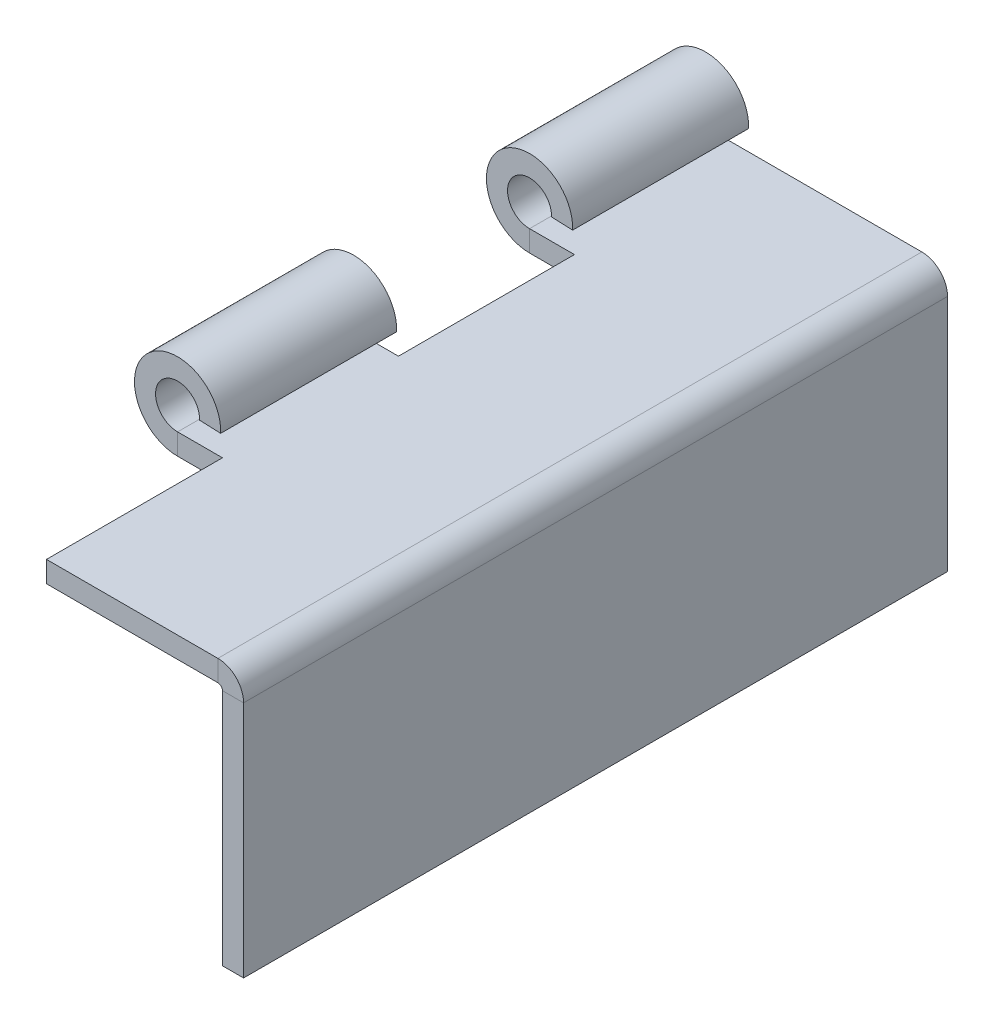
ISO-10303-21;
HEADER;
FILE_DESCRIPTION(('STEP AP214'),'2;1');
FILE_NAME('part.step','',(''),(''),'','','');
FILE_SCHEMA(('AUTOMOTIVE_DESIGN { 1 0 10303 214 1 1 1 1 }'));
ENDSEC;
DATA;
#1=APPLICATION_CONTEXT('core data for automotive mechanical design processes');
#2=APPLICATION_PROTOCOL_DEFINITION('international standard','automotive_design',2000,#1);
#3=PRODUCT_CONTEXT('',#1,'mechanical');
#4=PRODUCT('Part','Part','',(#3));
#5=PRODUCT_RELATED_PRODUCT_CATEGORY('part','',(#4));
#6=PRODUCT_DEFINITION_FORMATION('','',#4);
#7=PRODUCT_DEFINITION_CONTEXT('part definition',#1,'design');
#8=PRODUCT_DEFINITION('design','',#6,#7);
#9=PRODUCT_DEFINITION_SHAPE('','',#8);
#10=(LENGTH_UNIT() NAMED_UNIT(*) SI_UNIT(.MILLI.,.METRE.));
#11=(NAMED_UNIT(*) PLANE_ANGLE_UNIT() SI_UNIT($,.RADIAN.));
#12=(NAMED_UNIT(*) SI_UNIT($,.STERADIAN.) SOLID_ANGLE_UNIT());
#13=UNCERTAINTY_MEASURE_WITH_UNIT(LENGTH_MEASURE(1.E-05),#10,'distance_accuracy_value','');
#14=(GEOMETRIC_REPRESENTATION_CONTEXT(3) GLOBAL_UNCERTAINTY_ASSIGNED_CONTEXT((#13)) GLOBAL_UNIT_ASSIGNED_CONTEXT((#10,
#11,#12)) REPRESENTATION_CONTEXT('',''));
#15=CARTESIAN_POINT('',(0.,0.,0.));
#16=DIRECTION('',(0.,0.,1.));
#17=DIRECTION('',(1.,0.,0.));
#18=AXIS2_PLACEMENT_3D('',#15,#16,#17);
#19=CARTESIAN_POINT('',(0.,-1.524,50.8));
#20=DIRECTION('',(0.,-1.,0.));
#21=DIRECTION('',(1.,0.,0.));
#22=AXIS2_PLACEMENT_3D('',#19,#20,#21);
#23=PLANE('',#22);
#24=DIRECTION('',(-1.,0.,0.));
#25=VECTOR('',#24,1.);
#26=CARTESIAN_POINT('',(0.,-1.524,0.));
#27=LINE('',#26,#25);
#28=CARTESIAN_POINT('',(-1.8542,-1.524,0.));
#29=VERTEX_POINT('',#28);
#30=CARTESIAN_POINT('',(-17.4625,-1.524,0.));
#31=VERTEX_POINT('',#30);
#32=EDGE_CURVE('E310',#29,#31,#27,.T.);
#33=ORIENTED_EDGE('',*,*,#32,.F.);
#34=DIRECTION('',(0.,0.,1.));
#35=VECTOR('',#34,1.);
#36=CARTESIAN_POINT('',(-1.8542,-1.524,50.8));
#37=LINE('',#36,#35);
#38=CARTESIAN_POINT('',(-1.8542,-1.524,50.8));
#39=VERTEX_POINT('',#38);
#40=EDGE_CURVE('E77',#39,#29,#37,.F.);
#41=ORIENTED_EDGE('',*,*,#40,.F.);
#42=DIRECTION('',(-1.,0.,0.));
#43=VECTOR('',#42,1.);
#44=CARTESIAN_POINT('',(0.,-1.524,50.8));
#45=LINE('',#44,#43);
#46=CARTESIAN_POINT('',(-14.224,-1.524,50.8));
#47=VERTEX_POINT('',#46);
#48=EDGE_CURVE('E296',#39,#47,#45,.T.);
#49=ORIENTED_EDGE('',*,*,#48,.T.);
#50=DIRECTION('',(0.,0.,1.));
#51=VECTOR('',#50,1.);
#52=CARTESIAN_POINT('',(-14.224,-1.524,50.8));
#53=LINE('',#52,#51);
#54=CARTESIAN_POINT('',(-14.224,-1.524,38.1));
#55=VERTEX_POINT('',#54);
#56=EDGE_CURVE('E276',#55,#47,#53,.T.);
#57=ORIENTED_EDGE('',*,*,#56,.F.);
#58=DIRECTION('',(1.,0.,0.));
#59=VECTOR('',#58,1.);
#60=CARTESIAN_POINT('',(-14.224,-1.524,38.1));
#61=LINE('',#60,#59);
#62=CARTESIAN_POINT('',(-17.4625,-1.524,38.1));
#63=VERTEX_POINT('',#62);
#64=EDGE_CURVE('E279',#63,#55,#61,.T.);
#65=ORIENTED_EDGE('',*,*,#64,.F.);
#66=DIRECTION('',(0.,0.,-1.));
#67=VECTOR('',#66,1.);
#68=CARTESIAN_POINT('',(-17.4625,-1.524,50.8));
#69=LINE('',#68,#67);
#70=CARTESIAN_POINT('',(-17.4625,-1.524,25.4));
#71=VERTEX_POINT('',#70);
#72=EDGE_CURVE('E317',#63,#71,#69,.T.);
#73=ORIENTED_EDGE('',*,*,#72,.T.);
#74=DIRECTION('',(-1.,0.,0.));
#75=VECTOR('',#74,1.);
#76=CARTESIAN_POINT('',(-14.224,-1.524,25.4));
#77=LINE('',#76,#75);
#78=CARTESIAN_POINT('',(-14.224,-1.524,25.4));
#79=VERTEX_POINT('',#78);
#80=EDGE_CURVE('E251',#79,#71,#77,.T.);
#81=ORIENTED_EDGE('',*,*,#80,.F.);
#82=DIRECTION('',(0.,0.,1.));
#83=VECTOR('',#82,1.);
#84=CARTESIAN_POINT('',(-14.224,-1.524,25.4));
#85=LINE('',#84,#83);
#86=CARTESIAN_POINT('',(-14.224,-1.524,12.7));
#87=VERTEX_POINT('',#86);
#88=EDGE_CURVE('E246',#87,#79,#85,.T.);
#89=ORIENTED_EDGE('',*,*,#88,.F.);
#90=DIRECTION('',(1.,0.,0.));
#91=VECTOR('',#90,1.);
#92=CARTESIAN_POINT('',(-14.224,-1.524,12.7));
#93=LINE('',#92,#91);
#94=CARTESIAN_POINT('',(-17.4625,-1.524,12.7));
#95=VERTEX_POINT('',#94);
#96=EDGE_CURVE('E254',#95,#87,#93,.T.);
#97=ORIENTED_EDGE('',*,*,#96,.F.);
#98=EDGE_CURVE('E316',#95,#31,#69,.T.);
#99=ORIENTED_EDGE('',*,*,#98,.T.);
#100=EDGE_LOOP('',(#33,#41,#49,#57,#65,#73,#81,#89,#97,#99));
#101=FACE_BOUND('',#100,.T.);
#102=ADVANCED_FACE('F62',(#101),#23,.T.);
#103=CARTESIAN_POINT('',(0.,0.,50.8));
#104=DIRECTION('',(0.,-1.,0.));
#105=DIRECTION('',(1.,0.,0.));
#106=AXIS2_PLACEMENT_3D('',#103,#104,#105);
#107=PLANE('',#106);
#108=DIRECTION('',(0.,0.,1.));
#109=VECTOR('',#108,1.);
#110=CARTESIAN_POINT('',(-1.8542,0.,50.8));
#111=LINE('',#110,#109);
#112=CARTESIAN_POINT('',(-1.8542,0.,50.8));
#113=VERTEX_POINT('',#112);
#114=CARTESIAN_POINT('',(-1.8542,0.,0.));
#115=VERTEX_POINT('',#114);
#116=EDGE_CURVE('E228',#113,#115,#111,.F.);
#117=ORIENTED_EDGE('',*,*,#116,.T.);
#118=DIRECTION('',(-1.,0.,0.));
#119=VECTOR('',#118,1.);
#120=CARTESIAN_POINT('',(0.,0.,0.));
#121=LINE('',#120,#119);
#122=CARTESIAN_POINT('',(-17.4625,0.,0.));
#123=VERTEX_POINT('',#122);
#124=EDGE_CURVE('E299',#115,#123,#121,.T.);
#125=ORIENTED_EDGE('',*,*,#124,.T.);
#126=DIRECTION('',(0.,0.,-1.));
#127=VECTOR('',#126,1.);
#128=CARTESIAN_POINT('',(-17.4625,0.,50.8));
#129=LINE('',#128,#127);
#130=CARTESIAN_POINT('',(-17.4625,0.,12.7));
#131=VERTEX_POINT('',#130);
#132=EDGE_CURVE('E301',#131,#123,#129,.T.);
#133=ORIENTED_EDGE('',*,*,#132,.F.);
#134=DIRECTION('',(1.,0.,0.));
#135=VECTOR('',#134,1.);
#136=CARTESIAN_POINT('',(0.,0.,12.7));
#137=LINE('',#136,#135);
#138=CARTESIAN_POINT('',(-14.224,0.,12.7));
#139=VERTEX_POINT('',#138);
#140=EDGE_CURVE('E345',#131,#139,#137,.T.);
#141=ORIENTED_EDGE('',*,*,#140,.T.);
#142=DIRECTION('',(0.,0.,1.));
#143=VECTOR('',#142,1.);
#144=CARTESIAN_POINT('',(-14.224,0.,50.8));
#145=LINE('',#144,#143);
#146=CARTESIAN_POINT('',(-14.224,0.,25.4));
#147=VERTEX_POINT('',#146);
#148=EDGE_CURVE('E342',#139,#147,#145,.T.);
#149=ORIENTED_EDGE('',*,*,#148,.T.);
#150=DIRECTION('',(-1.,0.,0.));
#151=VECTOR('',#150,1.);
#152=CARTESIAN_POINT('',(0.,0.,25.4));
#153=LINE('',#152,#151);
#154=CARTESIAN_POINT('',(-17.4625,0.,25.4));
#155=VERTEX_POINT('',#154);
#156=EDGE_CURVE('E339',#147,#155,#153,.T.);
#157=ORIENTED_EDGE('',*,*,#156,.T.);
#158=CARTESIAN_POINT('',(-17.4625,0.,38.1));
#159=VERTEX_POINT('',#158);
#160=EDGE_CURVE('E313',#159,#155,#129,.T.);
#161=ORIENTED_EDGE('',*,*,#160,.F.);
#162=DIRECTION('',(1.,0.,0.));
#163=VECTOR('',#162,1.);
#164=CARTESIAN_POINT('',(0.,0.,38.1));
#165=LINE('',#164,#163);
#166=CARTESIAN_POINT('',(-14.224,0.,38.1));
#167=VERTEX_POINT('',#166);
#168=EDGE_CURVE('E334',#159,#167,#165,.T.);
#169=ORIENTED_EDGE('',*,*,#168,.T.);
#170=DIRECTION('',(0.,0.,1.));
#171=VECTOR('',#170,1.);
#172=CARTESIAN_POINT('',(-14.224,0.,50.8));
#173=LINE('',#172,#171);
#174=CARTESIAN_POINT('',(-14.224,0.,50.8));
#175=VERTEX_POINT('',#174);
#176=EDGE_CURVE('E284',#167,#175,#173,.T.);
#177=ORIENTED_EDGE('',*,*,#176,.T.);
#178=DIRECTION('',(-1.,0.,0.));
#179=VECTOR('',#178,1.);
#180=CARTESIAN_POINT('',(0.,0.,50.8));
#181=LINE('',#180,#179);
#182=EDGE_CURVE('E298',#113,#175,#181,.T.);
#183=ORIENTED_EDGE('',*,*,#182,.F.);
#184=EDGE_LOOP('',(#117,#125,#133,#141,#149,#157,#161,#169,#177,#183));
#185=FACE_BOUND('',#184,.T.);
#186=ADVANCED_FACE('F418',(#185),#107,.F.);
#187=CARTESIAN_POINT('',(-17.4625,1.5875,50.8));
#188=DIRECTION('',(0.,0.,-1.));
#189=DIRECTION('',(-1.,0.,0.));
#190=AXIS2_PLACEMENT_3D('',#187,#188,#189);
#191=PLANE('',#190);
#192=DIRECTION('',(0.,1.,0.));
#193=VECTOR('',#192,1.);
#194=CARTESIAN_POINT('',(-1.8542,-1.524,50.8));
#195=LINE('',#194,#193);
#196=EDGE_CURVE('E235',#39,#113,#195,.T.);
#197=ORIENTED_EDGE('',*,*,#196,.T.);
#198=ORIENTED_EDGE('',*,*,#182,.T.);
#199=DIRECTION('',(0.,-1.,0.));
#200=VECTOR('',#199,1.);
#201=CARTESIAN_POINT('',(-14.224,1.5875,50.8));
#202=LINE('',#201,#200);
#203=EDGE_CURVE('E331',#175,#47,#202,.T.);
#204=ORIENTED_EDGE('',*,*,#203,.T.);
#205=ORIENTED_EDGE('',*,*,#48,.F.);
#206=EDGE_LOOP('',(#197,#198,#204,#205));
#207=FACE_BOUND('',#206,.T.);
#208=ADVANCED_FACE('F390',(#207),#191,.F.);
#209=CARTESIAN_POINT('',(-14.224,4.69899999999999,25.4));
#210=DIRECTION('',(0.,0.,1.));
#211=DIRECTION('',(1.,0.,0.));
#212=AXIS2_PLACEMENT_3D('',#209,#210,#211);
#213=PLANE('',#212);
#214=ORIENTED_EDGE('',*,*,#80,.T.);
#215=DIRECTION('',(0.,1.,0.));
#216=VECTOR('',#215,1.);
#217=CARTESIAN_POINT('',(-17.4625,-1.524,25.4));
#218=LINE('',#217,#216);
#219=EDGE_CURVE('E13',#71,#155,#218,.T.);
#220=ORIENTED_EDGE('',*,*,#219,.T.);
#221=ORIENTED_EDGE('',*,*,#156,.F.);
#222=DIRECTION('',(0.,-1.,0.));
#223=VECTOR('',#222,1.);
#224=CARTESIAN_POINT('',(-14.224,4.69899999999999,25.4));
#225=LINE('',#224,#223);
#226=EDGE_CURVE('E257',#147,#79,#225,.T.);
#227=ORIENTED_EDGE('',*,*,#226,.T.);
#228=EDGE_LOOP('',(#214,#220,#221,#227));
#229=FACE_BOUND('',#228,.T.);
#230=ADVANCED_FACE('F421',(#229),#213,.F.);
#231=CARTESIAN_POINT('',(-14.224,4.69899999999999,12.7));
#232=DIRECTION('',(0.,0.,-1.));
#233=DIRECTION('',(-1.,0.,0.));
#234=AXIS2_PLACEMENT_3D('',#231,#232,#233);
#235=PLANE('',#234);
#236=ORIENTED_EDGE('',*,*,#140,.F.);
#237=DIRECTION('',(0.,-1.,0.));
#238=VECTOR('',#237,1.);
#239=CARTESIAN_POINT('',(-17.4625,0.,12.7));
#240=LINE('',#239,#238);
#241=EDGE_CURVE('E70',#131,#95,#240,.T.);
#242=ORIENTED_EDGE('',*,*,#241,.T.);
#243=ORIENTED_EDGE('',*,*,#96,.T.);
#244=DIRECTION('',(0.,-1.,0.));
#245=VECTOR('',#244,1.);
#246=CARTESIAN_POINT('',(-14.224,4.69899999999999,12.7));
#247=LINE('',#246,#245);
#248=EDGE_CURVE('E258',#139,#87,#247,.T.);
#249=ORIENTED_EDGE('',*,*,#248,.F.);
#250=EDGE_LOOP('',(#236,#242,#243,#249));
#251=FACE_BOUND('',#250,.T.);
#252=ADVANCED_FACE('F349',(#251),#235,.F.);
#253=CARTESIAN_POINT('',(-17.4625,1.5875,50.8));
#254=DIRECTION('',(0.,0.,-1.));
#255=DIRECTION('',(-1.,0.,0.));
#256=AXIS2_PLACEMENT_3D('',#253,#254,#255);
#257=CYLINDRICAL_SURFACE('',#256,1.5875);
#258=DIRECTION('',(0.,0.,-1.));
#259=VECTOR('',#258,1.);
#260=CARTESIAN_POINT('',(-15.8762705084068,1.524,50.8));
#261=LINE('',#260,#259);
#262=CARTESIAN_POINT('',(-15.8762705084068,1.524,12.7));
#263=VERTEX_POINT('',#262);
#264=CARTESIAN_POINT('',(-15.8762705084068,1.524,0.));
#265=VERTEX_POINT('',#264);
#266=EDGE_CURVE('E324',#263,#265,#261,.T.);
#267=ORIENTED_EDGE('',*,*,#266,.F.);
#268=CARTESIAN_POINT('',(-17.4625,1.5875,12.7));
#269=DIRECTION('',(0.,0.,-1.));
#270=DIRECTION('',(-1.,0.,0.));
#271=AXIS2_PLACEMENT_3D('',#268,#269,#270);
#272=CIRCLE('',#271,1.5875);
#273=EDGE_CURVE('E268',#263,#131,#272,.F.);
#274=ORIENTED_EDGE('',*,*,#273,.T.);
#275=ORIENTED_EDGE('',*,*,#132,.T.);
#276=CARTESIAN_POINT('',(-17.4625,1.5875,0.));
#277=DIRECTION('',(0.,0.,-1.));
#278=DIRECTION('',(-1.,0.,0.));
#279=AXIS2_PLACEMENT_3D('',#276,#277,#278);
#280=CIRCLE('',#279,1.5875);
#281=EDGE_CURVE('E295',#123,#265,#280,.T.);
#282=ORIENTED_EDGE('',*,*,#281,.T.);
#283=EDGE_LOOP('',(#267,#274,#275,#282));
#284=FACE_BOUND('',#283,.T.);
#285=ADVANCED_FACE('F428',(#284),#257,.F.);
#286=CARTESIAN_POINT('',(-14.3534901964773,1.46304,50.8));
#287=DIRECTION('',(-0.0399999999999982,-0.999199679743744,0.));
#288=DIRECTION('',(0.999199679743744,-0.0399999999999982,0.));
#289=AXIS2_PLACEMENT_3D('',#286,#287,#288);
#290=PLANE('',#289);
#291=DIRECTION('',(0.999199679743744,-0.0399999999999982,0.));
#292=VECTOR('',#291,1.);
#293=CARTESIAN_POINT('',(-14.3534901964773,1.46304,12.7));
#294=LINE('',#293,#292);
#295=CARTESIAN_POINT('',(-14.3534901964773,1.46304,12.7));
#296=VERTEX_POINT('',#295);
#297=EDGE_CURVE('E271',#263,#296,#294,.T.);
#298=ORIENTED_EDGE('',*,*,#297,.F.);
#299=ORIENTED_EDGE('',*,*,#266,.T.);
#300=DIRECTION('',(-0.999199679743744,0.0399999999999982,0.));
#301=VECTOR('',#300,1.);
#302=CARTESIAN_POINT('',(-14.3534901964773,1.46304,0.));
#303=LINE('',#302,#301);
#304=CARTESIAN_POINT('',(-14.3534901964773,1.46304,0.));
#305=VERTEX_POINT('',#304);
#306=EDGE_CURVE('E304',#305,#265,#303,.T.);
#307=ORIENTED_EDGE('',*,*,#306,.F.);
#308=DIRECTION('',(0.,0.,-1.));
#309=VECTOR('',#308,1.);
#310=CARTESIAN_POINT('',(-14.3534901964773,1.46304,50.8));
#311=LINE('',#310,#309);
#312=EDGE_CURVE('E320',#296,#305,#311,.T.);
#313=ORIENTED_EDGE('',*,*,#312,.F.);
#314=EDGE_LOOP('',(#298,#299,#307,#313));
#315=FACE_BOUND('',#314,.T.);
#316=ADVANCED_FACE('F430',(#315),#290,.T.);
#317=CARTESIAN_POINT('',(-17.4625,1.5875,50.8));
#318=DIRECTION('',(0.,0.,-1.));
#319=DIRECTION('',(-1.,0.,0.));
#320=AXIS2_PLACEMENT_3D('',#317,#318,#319);
#321=CYLINDRICAL_SURFACE('',#320,3.1115);
#322=CARTESIAN_POINT('',(-17.4625,1.5875,25.4));
#323=DIRECTION('',(0.,0.,1.));
#324=DIRECTION('',(1.,0.,0.));
#325=AXIS2_PLACEMENT_3D('',#322,#323,#324);
#326=CIRCLE('',#325,3.1115);
#327=CARTESIAN_POINT('',(-14.3534901964773,1.46304,25.4));
#328=VERTEX_POINT('',#327);
#329=EDGE_CURVE('E266',#71,#328,#326,.F.);
#330=ORIENTED_EDGE('',*,*,#329,.F.);
#331=ORIENTED_EDGE('',*,*,#72,.F.);
#332=CARTESIAN_POINT('',(-17.4625,1.5875,38.1));
#333=DIRECTION('',(0.,0.,-1.));
#334=DIRECTION('',(-1.,0.,0.));
#335=AXIS2_PLACEMENT_3D('',#332,#333,#334);
#336=CIRCLE('',#335,3.1115);
#337=CARTESIAN_POINT('',(-14.3534901964773,1.46304,38.1));
#338=VERTEX_POINT('',#337);
#339=EDGE_CURVE('E292',#338,#63,#336,.F.);
#340=ORIENTED_EDGE('',*,*,#339,.F.);
#341=EDGE_CURVE('E321',#338,#328,#311,.T.);
#342=ORIENTED_EDGE('',*,*,#341,.T.);
#343=EDGE_LOOP('',(#330,#331,#340,#342));
#344=FACE_BOUND('',#343,.T.);
#345=ADVANCED_FACE('F404',(#344),#321,.T.);
#346=CARTESIAN_POINT('',(-14.224,4.69899999999999,38.1));
#347=DIRECTION('',(0.,0.,-1.));
#348=DIRECTION('',(-1.,0.,0.));
#349=AXIS2_PLACEMENT_3D('',#346,#347,#348);
#350=PLANE('',#349);
#351=ORIENTED_EDGE('',*,*,#168,.F.);
#352=DIRECTION('',(0.,-1.,0.));
#353=VECTOR('',#352,1.);
#354=CARTESIAN_POINT('',(-17.4625,0.,38.1));
#355=LINE('',#354,#353);
#356=EDGE_CURVE('E337',#159,#63,#355,.T.);
#357=ORIENTED_EDGE('',*,*,#356,.T.);
#358=ORIENTED_EDGE('',*,*,#64,.T.);
#359=DIRECTION('',(0.,-1.,0.));
#360=VECTOR('',#359,1.);
#361=CARTESIAN_POINT('',(-14.224,4.69899999999999,38.1));
#362=LINE('',#361,#360);
#363=EDGE_CURVE('E282',#167,#55,#362,.T.);
#364=ORIENTED_EDGE('',*,*,#363,.F.);
#365=EDGE_LOOP('',(#351,#357,#358,#364));
#366=FACE_BOUND('',#365,.T.);
#367=ADVANCED_FACE('F399',(#366),#350,.F.);
#368=CARTESIAN_POINT('',(-17.4625,-1.524,0.));
#369=DIRECTION('',(0.,0.,-1.));
#370=DIRECTION('',(-1.,0.,0.));
#371=AXIS2_PLACEMENT_3D('',#368,#369,#370);
#372=PLANE('',#371);
#373=DIRECTION('',(0.,1.,0.));
#374=VECTOR('',#373,1.);
#375=CARTESIAN_POINT('',(-17.4625,-1.524,0.));
#376=LINE('',#375,#374);
#377=EDGE_CURVE('E328',#31,#123,#376,.T.);
#378=ORIENTED_EDGE('',*,*,#377,.F.);
#379=CARTESIAN_POINT('',(-17.4625,1.5875,0.));
#380=DIRECTION('',(0.,0.,1.));
#381=DIRECTION('',(1.,0.,0.));
#382=AXIS2_PLACEMENT_3D('',#379,#380,#381);
#383=CIRCLE('',#382,3.1115);
#384=EDGE_CURVE('E307',#31,#305,#383,.F.);
#385=ORIENTED_EDGE('',*,*,#384,.T.);
#386=ORIENTED_EDGE('',*,*,#306,.T.);
#387=ORIENTED_EDGE('',*,*,#281,.F.);
#388=EDGE_LOOP('',(#378,#385,#386,#387));
#389=FACE_BOUND('',#388,.T.);
#390=ADVANCED_FACE('F64',(#389),#372,.T.);
#391=ORIENTED_EDGE('',*,*,#160,.T.);
#392=CARTESIAN_POINT('',(-17.4625,1.5875,25.4));
#393=DIRECTION('',(0.,0.,1.));
#394=DIRECTION('',(1.,0.,0.));
#395=AXIS2_PLACEMENT_3D('',#392,#393,#394);
#396=CIRCLE('',#395,1.5875);
#397=CARTESIAN_POINT('',(-15.8762705084068,1.524,25.4));
#398=VERTEX_POINT('',#397);
#399=EDGE_CURVE('E260',#155,#398,#396,.F.);
#400=ORIENTED_EDGE('',*,*,#399,.T.);
#401=CARTESIAN_POINT('',(-15.8762705084068,1.524,38.1));
#402=VERTEX_POINT('',#401);
#403=EDGE_CURVE('E325',#402,#398,#261,.T.);
#404=ORIENTED_EDGE('',*,*,#403,.F.);
#405=CARTESIAN_POINT('',(-17.4625,1.5875,38.1));
#406=DIRECTION('',(0.,0.,-1.));
#407=DIRECTION('',(-1.,0.,0.));
#408=AXIS2_PLACEMENT_3D('',#405,#406,#407);
#409=CIRCLE('',#408,1.5875);
#410=EDGE_CURVE('E287',#402,#159,#409,.F.);
#411=ORIENTED_EDGE('',*,*,#410,.T.);
#412=EDGE_LOOP('',(#391,#400,#404,#411));
#413=FACE_BOUND('',#412,.T.);
#414=ADVANCED_FACE('F415',(#413),#257,.F.);
#415=DIRECTION('',(-0.999199679743744,0.0399999999999982,0.));
#416=VECTOR('',#415,1.);
#417=CARTESIAN_POINT('',(-14.3534901964773,1.46304,25.4));
#418=LINE('',#417,#416);
#419=EDGE_CURVE('E264',#328,#398,#418,.T.);
#420=ORIENTED_EDGE('',*,*,#419,.F.);
#421=ORIENTED_EDGE('',*,*,#341,.F.);
#422=DIRECTION('',(0.999199679743744,-0.0399999999999982,0.));
#423=VECTOR('',#422,1.);
#424=CARTESIAN_POINT('',(-14.3534901964773,1.46304,38.1));
#425=LINE('',#424,#423);
#426=EDGE_CURVE('E290',#402,#338,#425,.T.);
#427=ORIENTED_EDGE('',*,*,#426,.F.);
#428=ORIENTED_EDGE('',*,*,#403,.T.);
#429=EDGE_LOOP('',(#420,#421,#427,#428));
#430=FACE_BOUND('',#429,.T.);
#431=ADVANCED_FACE('F411',(#430),#290,.T.);
#432=CARTESIAN_POINT('',(-17.4625,1.5875,12.7));
#433=DIRECTION('',(0.,0.,-1.));
#434=DIRECTION('',(-1.,0.,0.));
#435=AXIS2_PLACEMENT_3D('',#432,#433,#434);
#436=CIRCLE('',#435,3.1115);
#437=EDGE_CURVE('E273',#296,#95,#436,.F.);
#438=ORIENTED_EDGE('',*,*,#437,.F.);
#439=ORIENTED_EDGE('',*,*,#312,.T.);
#440=ORIENTED_EDGE('',*,*,#384,.F.);
#441=ORIENTED_EDGE('',*,*,#98,.F.);
#442=EDGE_LOOP('',(#438,#439,#440,#441));
#443=FACE_BOUND('',#442,.T.);
#444=ADVANCED_FACE('F364',(#443),#321,.T.);
#445=CARTESIAN_POINT('',(-17.4625,1.5875,0.));
#446=DIRECTION('',(0.,0.,-1.));
#447=DIRECTION('',(-1.,0.,0.));
#448=AXIS2_PLACEMENT_3D('',#445,#446,#447);
#449=PLANE('',#448);
#450=DIRECTION('',(0.,1.,0.));
#451=VECTOR('',#450,1.);
#452=CARTESIAN_POINT('',(-1.8542,-1.524,0.));
#453=LINE('',#452,#451);
#454=EDGE_CURVE('E85',#29,#115,#453,.T.);
#455=ORIENTED_EDGE('',*,*,#454,.F.);
#456=ORIENTED_EDGE('',*,*,#32,.T.);
#457=ORIENTED_EDGE('',*,*,#377,.T.);
#458=ORIENTED_EDGE('',*,*,#124,.F.);
#459=EDGE_LOOP('',(#455,#456,#457,#458));
#460=FACE_BOUND('',#459,.T.);
#461=ADVANCED_FACE('F368',(#460),#449,.T.);
#462=CARTESIAN_POINT('',(-14.224,4.69899999999999,50.8));
#463=DIRECTION('',(1.,0.,0.));
#464=DIRECTION('',(0.,0.,-1.));
#465=AXIS2_PLACEMENT_3D('',#462,#463,#464);
#466=PLANE('',#465);
#467=ORIENTED_EDGE('',*,*,#363,.T.);
#468=ORIENTED_EDGE('',*,*,#56,.T.);
#469=ORIENTED_EDGE('',*,*,#203,.F.);
#470=ORIENTED_EDGE('',*,*,#176,.F.);
#471=EDGE_LOOP('',(#467,#468,#469,#470));
#472=FACE_BOUND('',#471,.T.);
#473=ADVANCED_FACE('F395',(#472),#466,.F.);
#474=ORIENTED_EDGE('',*,*,#356,.F.);
#475=ORIENTED_EDGE('',*,*,#410,.F.);
#476=ORIENTED_EDGE('',*,*,#426,.T.);
#477=ORIENTED_EDGE('',*,*,#339,.T.);
#478=EDGE_LOOP('',(#474,#475,#476,#477));
#479=FACE_BOUND('',#478,.T.);
#480=ADVANCED_FACE('F453',(#479),#350,.F.);
#481=CARTESIAN_POINT('',(-14.224,4.69899999999999,25.4));
#482=DIRECTION('',(1.,0.,0.));
#483=DIRECTION('',(0.,0.,-1.));
#484=AXIS2_PLACEMENT_3D('',#481,#482,#483);
#485=PLANE('',#484);
#486=ORIENTED_EDGE('',*,*,#248,.T.);
#487=ORIENTED_EDGE('',*,*,#88,.T.);
#488=ORIENTED_EDGE('',*,*,#226,.F.);
#489=ORIENTED_EDGE('',*,*,#148,.F.);
#490=EDGE_LOOP('',(#486,#487,#488,#489));
#491=FACE_BOUND('',#490,.T.);
#492=ADVANCED_FACE('F423',(#491),#485,.F.);
#493=ORIENTED_EDGE('',*,*,#241,.F.);
#494=ORIENTED_EDGE('',*,*,#273,.F.);
#495=ORIENTED_EDGE('',*,*,#297,.T.);
#496=ORIENTED_EDGE('',*,*,#437,.T.);
#497=EDGE_LOOP('',(#493,#494,#495,#496));
#498=FACE_BOUND('',#497,.T.);
#499=ADVANCED_FACE('F355',(#498),#235,.F.);
#500=ORIENTED_EDGE('',*,*,#219,.F.);
#501=ORIENTED_EDGE('',*,*,#329,.T.);
#502=ORIENTED_EDGE('',*,*,#419,.T.);
#503=ORIENTED_EDGE('',*,*,#399,.F.);
#504=EDGE_LOOP('',(#500,#501,#502,#503));
#505=FACE_BOUND('',#504,.T.);
#506=ADVANCED_FACE('F408',(#505),#213,.F.);
#507=CARTESIAN_POINT('',(-1.8542,-1.8542,0.));
#508=DIRECTION('',(0.,0.,-1.));
#509=DIRECTION('',(-1.,0.,0.));
#510=AXIS2_PLACEMENT_3D('',#507,#508,#509);
#511=PLANE('',#510);
#512=DIRECTION('',(-1.,0.,0.));
#513=VECTOR('',#512,1.);
#514=CARTESIAN_POINT('',(0.,-1.85419999999999,0.));
#515=LINE('',#514,#513);
#516=CARTESIAN_POINT('',(-1.524,-1.8542,0.));
#517=VERTEX_POINT('',#516);
#518=CARTESIAN_POINT('',(0.,-1.85419999999999,0.));
#519=VERTEX_POINT('',#518);
#520=EDGE_CURVE('E210',#517,#519,#515,.F.);
#521=ORIENTED_EDGE('',*,*,#520,.F.);
#522=CARTESIAN_POINT('',(-1.8542,-1.8542,0.));
#523=DIRECTION('',(0.,0.,1.));
#524=DIRECTION('',(1.,0.,0.));
#525=AXIS2_PLACEMENT_3D('',#522,#523,#524);
#526=CIRCLE('',#525,0.3302);
#527=EDGE_CURVE('E238',#29,#517,#526,.F.);
#528=ORIENTED_EDGE('',*,*,#527,.F.);
#529=ORIENTED_EDGE('',*,*,#454,.T.);
#530=CARTESIAN_POINT('',(-1.8542,-1.8542,0.));
#531=DIRECTION('',(0.,0.,1.));
#532=DIRECTION('',(1.,0.,0.));
#533=AXIS2_PLACEMENT_3D('',#530,#531,#532);
#534=CIRCLE('',#533,1.8542);
#535=EDGE_CURVE('E231',#115,#519,#534,.F.);
#536=ORIENTED_EDGE('',*,*,#535,.T.);
#537=EDGE_LOOP('',(#521,#528,#529,#536));
#538=FACE_BOUND('',#537,.T.);
#539=ADVANCED_FACE('F375',(#538),#511,.T.);
#540=CARTESIAN_POINT('',(-1.8542,-1.8542,50.8));
#541=DIRECTION('',(0.,0.,-1.));
#542=DIRECTION('',(-1.,0.,0.));
#543=AXIS2_PLACEMENT_3D('',#540,#541,#542);
#544=PLANE('',#543);
#545=CARTESIAN_POINT('',(-1.8542,-1.8542,50.8));
#546=DIRECTION('',(0.,0.,1.));
#547=DIRECTION('',(1.,0.,0.));
#548=AXIS2_PLACEMENT_3D('',#545,#546,#547);
#549=CIRCLE('',#548,0.3302);
#550=CARTESIAN_POINT('',(-1.524,-1.8542,50.8));
#551=VERTEX_POINT('',#550);
#552=EDGE_CURVE('E242',#551,#39,#549,.T.);
#553=ORIENTED_EDGE('',*,*,#552,.F.);
#554=DIRECTION('',(-1.,0.,0.));
#555=VECTOR('',#554,1.);
#556=CARTESIAN_POINT('',(-1.524,-1.8542,50.8));
#557=LINE('',#556,#555);
#558=CARTESIAN_POINT('',(0.,-1.85419999999999,50.8));
#559=VERTEX_POINT('',#558);
#560=EDGE_CURVE('E222',#551,#559,#557,.F.);
#561=ORIENTED_EDGE('',*,*,#560,.T.);
#562=CARTESIAN_POINT('',(-1.8542,-1.8542,50.8));
#563=DIRECTION('',(0.,0.,1.));
#564=DIRECTION('',(1.,0.,0.));
#565=AXIS2_PLACEMENT_3D('',#562,#563,#564);
#566=CIRCLE('',#565,1.8542);
#567=EDGE_CURVE('E232',#559,#113,#566,.T.);
#568=ORIENTED_EDGE('',*,*,#567,.T.);
#569=ORIENTED_EDGE('',*,*,#196,.F.);
#570=EDGE_LOOP('',(#553,#561,#568,#569));
#571=FACE_BOUND('',#570,.T.);
#572=ADVANCED_FACE('F388',(#571),#544,.F.);
#573=CARTESIAN_POINT('',(-1.8542,-1.8542,50.8));
#574=DIRECTION('',(0.,0.,1.));
#575=DIRECTION('',(1.,0.,0.));
#576=AXIS2_PLACEMENT_3D('',#573,#574,#575);
#577=CYLINDRICAL_SURFACE('',#576,1.8542);
#578=ORIENTED_EDGE('',*,*,#116,.F.);
#579=ORIENTED_EDGE('',*,*,#567,.F.);
#580=DIRECTION('',(0.,0.,1.));
#581=VECTOR('',#580,1.);
#582=CARTESIAN_POINT('',(0.,-1.85419999999999,0.));
#583=LINE('',#582,#581);
#584=EDGE_CURVE('E220',#559,#519,#583,.F.);
#585=ORIENTED_EDGE('',*,*,#584,.T.);
#586=ORIENTED_EDGE('',*,*,#535,.F.);
#587=EDGE_LOOP('',(#578,#579,#585,#586));
#588=FACE_BOUND('',#587,.T.);
#589=ADVANCED_FACE('F379',(#588),#577,.T.);
#590=CARTESIAN_POINT('',(-1.8542,-1.8542,50.8));
#591=DIRECTION('',(0.,0.,1.));
#592=DIRECTION('',(1.,0.,0.));
#593=AXIS2_PLACEMENT_3D('',#590,#591,#592);
#594=CYLINDRICAL_SURFACE('',#593,0.3302);
#595=ORIENTED_EDGE('',*,*,#40,.T.);
#596=ORIENTED_EDGE('',*,*,#527,.T.);
#597=DIRECTION('',(0.,0.,1.));
#598=VECTOR('',#597,1.);
#599=CARTESIAN_POINT('',(-1.524,-1.8542,0.));
#600=LINE('',#599,#598);
#601=EDGE_CURVE('E225',#517,#551,#600,.T.);
#602=ORIENTED_EDGE('',*,*,#601,.T.);
#603=ORIENTED_EDGE('',*,*,#552,.T.);
#604=EDGE_LOOP('',(#595,#596,#602,#603));
#605=FACE_BOUND('',#604,.T.);
#606=ADVANCED_FACE('F371',(#605),#594,.F.);
#607=CARTESIAN_POINT('',(0.,-19.05,50.8));
#608=DIRECTION('',(0.,0.,-1.));
#609=DIRECTION('',(-1.,0.,0.));
#610=AXIS2_PLACEMENT_3D('',#607,#608,#609);
#611=PLANE('',#610);
#612=ORIENTED_EDGE('',*,*,#560,.F.);
#613=DIRECTION('',(0.,1.,0.));
#614=VECTOR('',#613,1.);
#615=CARTESIAN_POINT('',(-1.52399999999994,-19.05,50.8));
#616=LINE('',#615,#614);
#617=CARTESIAN_POINT('',(-1.52399999999994,-19.05,50.8));
#618=VERTEX_POINT('',#617);
#619=EDGE_CURVE('E218',#551,#618,#616,.F.);
#620=ORIENTED_EDGE('',*,*,#619,.T.);
#621=DIRECTION('',(-1.,0.,0.));
#622=VECTOR('',#621,1.);
#623=CARTESIAN_POINT('',(0.,-19.05,50.8));
#624=LINE('',#623,#622);
#625=CARTESIAN_POINT('',(0.,-19.05,50.8));
#626=VERTEX_POINT('',#625);
#627=EDGE_CURVE('E206',#626,#618,#624,.T.);
#628=ORIENTED_EDGE('',*,*,#627,.F.);
#629=DIRECTION('',(0.,-1.,0.));
#630=VECTOR('',#629,1.);
#631=CARTESIAN_POINT('',(0.,0.,50.8));
#632=LINE('',#631,#630);
#633=EDGE_CURVE('E193',#559,#626,#632,.T.);
#634=ORIENTED_EDGE('',*,*,#633,.F.);
#635=EDGE_LOOP('',(#612,#620,#628,#634));
#636=FACE_BOUND('',#635,.T.);
#637=ADVANCED_FACE('F382',(#636),#611,.F.);
#638=CARTESIAN_POINT('',(0.,-1.52399999999999,0.));
#639=DIRECTION('',(0.,0.,1.));
#640=DIRECTION('',(1.,0.,0.));
#641=AXIS2_PLACEMENT_3D('',#638,#639,#640);
#642=PLANE('',#641);
#643=ORIENTED_EDGE('',*,*,#520,.T.);
#644=DIRECTION('',(0.,1.,0.));
#645=VECTOR('',#644,1.);
#646=CARTESIAN_POINT('',(0.,0.,0.));
#647=LINE('',#646,#645);
#648=CARTESIAN_POINT('',(0.,-19.05,0.));
#649=VERTEX_POINT('',#648);
#650=EDGE_CURVE('E191',#649,#519,#647,.T.);
#651=ORIENTED_EDGE('',*,*,#650,.F.);
#652=DIRECTION('',(-1.,0.,0.));
#653=VECTOR('',#652,1.);
#654=CARTESIAN_POINT('',(0.,-19.05,0.));
#655=LINE('',#654,#653);
#656=CARTESIAN_POINT('',(-1.52399999999994,-19.05,0.));
#657=VERTEX_POINT('',#656);
#658=EDGE_CURVE('E199',#649,#657,#655,.T.);
#659=ORIENTED_EDGE('',*,*,#658,.T.);
#660=DIRECTION('',(0.,-1.,0.));
#661=VECTOR('',#660,1.);
#662=CARTESIAN_POINT('',(-1.524,-1.524,0.));
#663=LINE('',#662,#661);
#664=EDGE_CURVE('E215',#657,#517,#663,.F.);
#665=ORIENTED_EDGE('',*,*,#664,.T.);
#666=EDGE_LOOP('',(#643,#651,#659,#665));
#667=FACE_BOUND('',#666,.T.);
#668=ADVANCED_FACE('F209',(#667),#642,.F.);
#669=CARTESIAN_POINT('',(0.,0.,0.));
#670=DIRECTION('',(-1.,0.,0.));
#671=DIRECTION('',(0.,-1.,0.));
#672=AXIS2_PLACEMENT_3D('',#669,#670,#671);
#673=PLANE('',#672);
#674=ORIENTED_EDGE('',*,*,#584,.F.);
#675=ORIENTED_EDGE('',*,*,#633,.T.);
#676=DIRECTION('',(0.,0.,-1.));
#677=VECTOR('',#676,1.);
#678=CARTESIAN_POINT('',(0.,-19.05,0.));
#679=LINE('',#678,#677);
#680=EDGE_CURVE('E186',#626,#649,#679,.T.);
#681=ORIENTED_EDGE('',*,*,#680,.T.);
#682=ORIENTED_EDGE('',*,*,#650,.T.);
#683=EDGE_LOOP('',(#674,#675,#681,#682));
#684=FACE_BOUND('',#683,.T.);
#685=ADVANCED_FACE('F189',(#684),#673,.F.);
#686=CARTESIAN_POINT('',(-1.52400000000001,0.,0.));
#687=DIRECTION('',(-1.,0.,0.));
#688=DIRECTION('',(0.,-1.,0.));
#689=AXIS2_PLACEMENT_3D('',#686,#687,#688);
#690=PLANE('',#689);
#691=ORIENTED_EDGE('',*,*,#619,.F.);
#692=ORIENTED_EDGE('',*,*,#601,.F.);
#693=ORIENTED_EDGE('',*,*,#664,.F.);
#694=DIRECTION('',(0.,0.,1.));
#695=VECTOR('',#694,1.);
#696=CARTESIAN_POINT('',(-1.52399999999994,-19.05,0.));
#697=LINE('',#696,#695);
#698=EDGE_CURVE('E202',#618,#657,#697,.F.);
#699=ORIENTED_EDGE('',*,*,#698,.F.);
#700=EDGE_LOOP('',(#691,#692,#693,#699));
#701=FACE_BOUND('',#700,.T.);
#702=ADVANCED_FACE('F385',(#701),#690,.T.);
#703=CARTESIAN_POINT('',(0.,-19.05,0.));
#704=DIRECTION('',(0.,1.,0.));
#705=DIRECTION('',(-1.,0.,0.));
#706=AXIS2_PLACEMENT_3D('',#703,#704,#705);
#707=PLANE('',#706);
#708=ORIENTED_EDGE('',*,*,#698,.T.);
#709=ORIENTED_EDGE('',*,*,#658,.F.);
#710=ORIENTED_EDGE('',*,*,#680,.F.);
#711=ORIENTED_EDGE('',*,*,#627,.T.);
#712=EDGE_LOOP('',(#708,#709,#710,#711));
#713=FACE_BOUND('',#712,.T.);
#714=ADVANCED_FACE('F200',(#713),#707,.F.);
#715=CLOSED_SHELL('',(#102,#186,#208,#230,#252,#285,#316,#345,#367,#390,#414,#431,#444,#461,
#473,#480,#492,#499,#506,#539,#572,#589,#606,#637,#668,#685,#702,#714));
#716=MANIFOLD_SOLID_BREP('B2',#715);
#717=ADVANCED_BREP_SHAPE_REPRESENTATION('',(#18,#716),#14);
#718=SHAPE_DEFINITION_REPRESENTATION(#9,#717);
ENDSEC;
END-ISO-10303-21;
